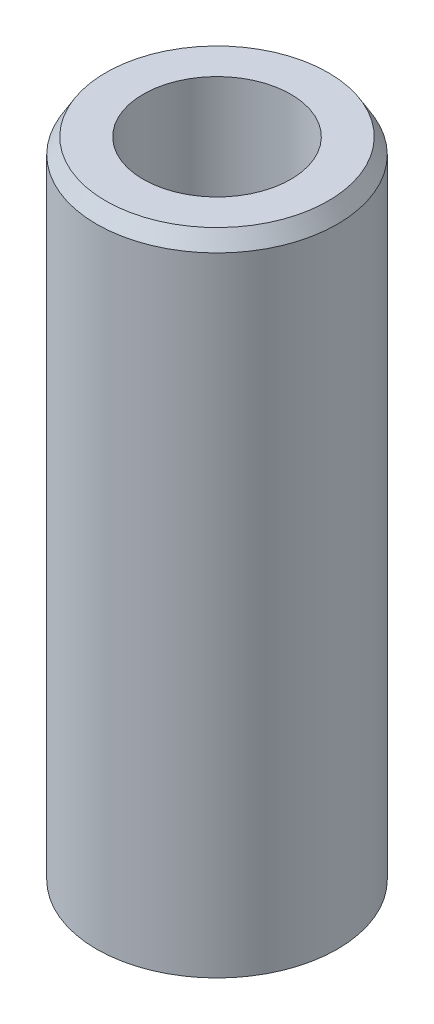
ISO-10303-21;
HEADER;
FILE_DESCRIPTION(('STEP AP214'),'2;1');
FILE_NAME('part.step','',(''),(''),'','','');
FILE_SCHEMA(('AUTOMOTIVE_DESIGN { 1 0 10303 214 1 1 1 1 }'));
ENDSEC;
DATA;
#1=APPLICATION_CONTEXT('core data for automotive mechanical design processes');
#2=APPLICATION_PROTOCOL_DEFINITION('international standard','automotive_design',2000,#1);
#3=PRODUCT_CONTEXT('',#1,'mechanical');
#4=PRODUCT('Part','Part','',(#3));
#5=PRODUCT_RELATED_PRODUCT_CATEGORY('part','',(#4));
#6=PRODUCT_DEFINITION_FORMATION('','',#4);
#7=PRODUCT_DEFINITION_CONTEXT('part definition',#1,'design');
#8=PRODUCT_DEFINITION('design','',#6,#7);
#9=PRODUCT_DEFINITION_SHAPE('','',#8);
#10=(LENGTH_UNIT() NAMED_UNIT(*) SI_UNIT(.MILLI.,.METRE.));
#11=(NAMED_UNIT(*) PLANE_ANGLE_UNIT() SI_UNIT($,.RADIAN.));
#12=(NAMED_UNIT(*) SI_UNIT($,.STERADIAN.) SOLID_ANGLE_UNIT());
#13=UNCERTAINTY_MEASURE_WITH_UNIT(LENGTH_MEASURE(1.E-05),#10,'distance_accuracy_value','');
#14=(GEOMETRIC_REPRESENTATION_CONTEXT(3) GLOBAL_UNCERTAINTY_ASSIGNED_CONTEXT((#13)) GLOBAL_UNIT_ASSIGNED_CONTEXT((#10,
#11,#12)) REPRESENTATION_CONTEXT('',''));
#15=CARTESIAN_POINT('',(0.,0.,0.));
#16=DIRECTION('',(0.,0.,1.));
#17=DIRECTION('',(1.,0.,0.));
#18=AXIS2_PLACEMENT_3D('',#15,#16,#17);
#19=CARTESIAN_POINT('',(0.,108.387746693689,0.));
#20=DIRECTION('',(0.,-1.,0.));
#21=DIRECTION('',(0.,0.,-1.));
#22=AXIS2_PLACEMENT_3D('',#19,#20,#21);
#23=CYLINDRICAL_SURFACE('',#22,20.);
#24=CARTESIAN_POINT('',(0.,105.812738045481,0.));
#25=DIRECTION('',(0.,1.,0.));
#26=DIRECTION('',(0.,0.,1.));
#27=AXIS2_PLACEMENT_3D('',#24,#25,#26);
#28=CIRCLE('',#27,20.);
#29=CARTESIAN_POINT('',(0.,105.812738045481,20.));
#30=VERTEX_POINT('',#29);
#31=EDGE_CURVE('E50',#30,#30,#28,.F.);
#32=ORIENTED_EDGE('',*,*,#31,.T.);
#33=EDGE_LOOP('',(#32));
#34=FACE_BOUND('',#33,.T.);
#35=CARTESIAN_POINT('',(0.,1.529502968228,0.));
#36=DIRECTION('',(0.,1.,0.));
#37=DIRECTION('',(0.,0.,1.));
#38=AXIS2_PLACEMENT_3D('',#35,#36,#37);
#39=CIRCLE('',#38,20.);
#40=CARTESIAN_POINT('',(0.,1.529502968228,20.));
#41=VERTEX_POINT('',#40);
#42=EDGE_CURVE('E51',#41,#41,#39,.T.);
#43=ORIENTED_EDGE('',*,*,#42,.T.);
#44=EDGE_LOOP('',(#43));
#45=FACE_BOUND('',#44,.T.);
#46=ADVANCED_FACE('F39',(#34,#45),#23,.T.);
#47=CARTESIAN_POINT('',(0.,108.387746693689,0.));
#48=DIRECTION('',(0.,1.,0.));
#49=DIRECTION('',(0.,0.,1.));
#50=AXIS2_PLACEMENT_3D('',#47,#48,#49);
#51=PLANE('',#50);
#52=CARTESIAN_POINT('',(0.,108.387746693689,0.));
#53=DIRECTION('',(0.,1.,0.));
#54=DIRECTION('',(0.,0.,1.));
#55=AXIS2_PLACEMENT_3D('',#52,#53,#54);
#56=CIRCLE('',#55,18.470497031772);
#57=CARTESIAN_POINT('',(0.,108.387746693689,18.470497031772));
#58=VERTEX_POINT('',#57);
#59=EDGE_CURVE('E54',#58,#58,#56,.T.);
#60=ORIENTED_EDGE('',*,*,#59,.T.);
#61=EDGE_LOOP('',(#60));
#62=FACE_BOUND('',#61,.T.);
#63=CARTESIAN_POINT('',(0.,108.387746693689,0.));
#64=DIRECTION('',(0.,1.,0.));
#65=DIRECTION('',(0.,0.,1.));
#66=AXIS2_PLACEMENT_3D('',#63,#64,#65);
#67=CIRCLE('',#66,12.255545424367);
#68=CARTESIAN_POINT('',(0.,108.387746693689,12.255545424367));
#69=VERTEX_POINT('',#68);
#70=EDGE_CURVE('E58',#69,#69,#67,.T.);
#71=ORIENTED_EDGE('',*,*,#70,.F.);
#72=EDGE_LOOP('',(#71));
#73=FACE_BOUND('',#72,.T.);
#74=ADVANCED_FACE('F69',(#62,#73),#51,.T.);
#75=CARTESIAN_POINT('',(0.,0.,0.));
#76=DIRECTION('',(0.,1.,0.));
#77=DIRECTION('',(0.,0.,1.));
#78=AXIS2_PLACEMENT_3D('',#75,#76,#77);
#79=PLANE('',#78);
#80=CARTESIAN_POINT('',(0.,0.,0.));
#81=DIRECTION('',(0.,1.,0.));
#82=DIRECTION('',(0.,0.,1.));
#83=AXIS2_PLACEMENT_3D('',#80,#81,#82);
#84=CIRCLE('',#83,17.4249913517913);
#85=CARTESIAN_POINT('',(0.,0.,17.4249913517913));
#86=VERTEX_POINT('',#85);
#87=EDGE_CURVE('E10',#86,#86,#84,.F.);
#88=ORIENTED_EDGE('',*,*,#87,.T.);
#89=EDGE_LOOP('',(#88));
#90=FACE_BOUND('',#89,.T.);
#91=CARTESIAN_POINT('',(0.,0.,0.));
#92=DIRECTION('',(0.,1.,0.));
#93=DIRECTION('',(0.,0.,1.));
#94=AXIS2_PLACEMENT_3D('',#91,#92,#93);
#95=CIRCLE('',#94,12.255545424367);
#96=CARTESIAN_POINT('',(0.,0.,12.255545424367));
#97=VERTEX_POINT('',#96);
#98=EDGE_CURVE('E63',#97,#97,#95,.T.);
#99=ORIENTED_EDGE('',*,*,#98,.T.);
#100=EDGE_LOOP('',(#99));
#101=FACE_BOUND('',#100,.T.);
#102=ADVANCED_FACE('F75',(#90,#101),#79,.F.);
#103=CARTESIAN_POINT('',(0.,108.387746693689,0.));
#104=DIRECTION('',(0.,-1.,0.));
#105=DIRECTION('',(0.,0.,-1.));
#106=AXIS2_PLACEMENT_3D('',#103,#104,#105);
#107=CYLINDRICAL_SURFACE('',#106,12.255545424367);
#108=ORIENTED_EDGE('',*,*,#70,.T.);
#109=EDGE_LOOP('',(#108));
#110=FACE_BOUND('',#109,.T.);
#111=ORIENTED_EDGE('',*,*,#98,.F.);
#112=EDGE_LOOP('',(#111));
#113=FACE_BOUND('',#112,.T.);
#114=ADVANCED_FACE('F70',(#110,#113),#107,.F.);
#115=CARTESIAN_POINT('',(0.,108.387746693689,0.));
#116=DIRECTION('',(0.,-1.,0.));
#117=DIRECTION('',(0.,0.,-1.));
#118=AXIS2_PLACEMENT_3D('',#115,#116,#117);
#119=CONICAL_SURFACE('',#118,18.470497031772,0.535981079389203);
#120=ORIENTED_EDGE('',*,*,#31,.F.);
#121=EDGE_LOOP('',(#120));
#122=FACE_BOUND('',#121,.T.);
#123=ORIENTED_EDGE('',*,*,#59,.F.);
#124=EDGE_LOOP('',(#123));
#125=FACE_BOUND('',#124,.T.);
#126=ADVANCED_FACE('F81',(#122,#125),#119,.T.);
#127=CARTESIAN_POINT('',(0.,1.529502968228,0.));
#128=DIRECTION('',(0.,1.,0.));
#129=DIRECTION('',(0.,0.,1.));
#130=AXIS2_PLACEMENT_3D('',#127,#128,#129);
#131=CONICAL_SURFACE('',#130,20.,1.0348152474057);
#132=ORIENTED_EDGE('',*,*,#87,.F.);
#133=EDGE_LOOP('',(#132));
#134=FACE_BOUND('',#133,.T.);
#135=ORIENTED_EDGE('',*,*,#42,.F.);
#136=EDGE_LOOP('',(#135));
#137=FACE_BOUND('',#136,.T.);
#138=ADVANCED_FACE('F45',(#134,#137),#131,.T.);
#139=CLOSED_SHELL('',(#46,#74,#102,#114,#126,#138));
#140=MANIFOLD_SOLID_BREP('B2',#139);
#141=ADVANCED_BREP_SHAPE_REPRESENTATION('',(#18,#140),#14);
#142=SHAPE_DEFINITION_REPRESENTATION(#9,#141);
ENDSEC;
END-ISO-10303-21;
